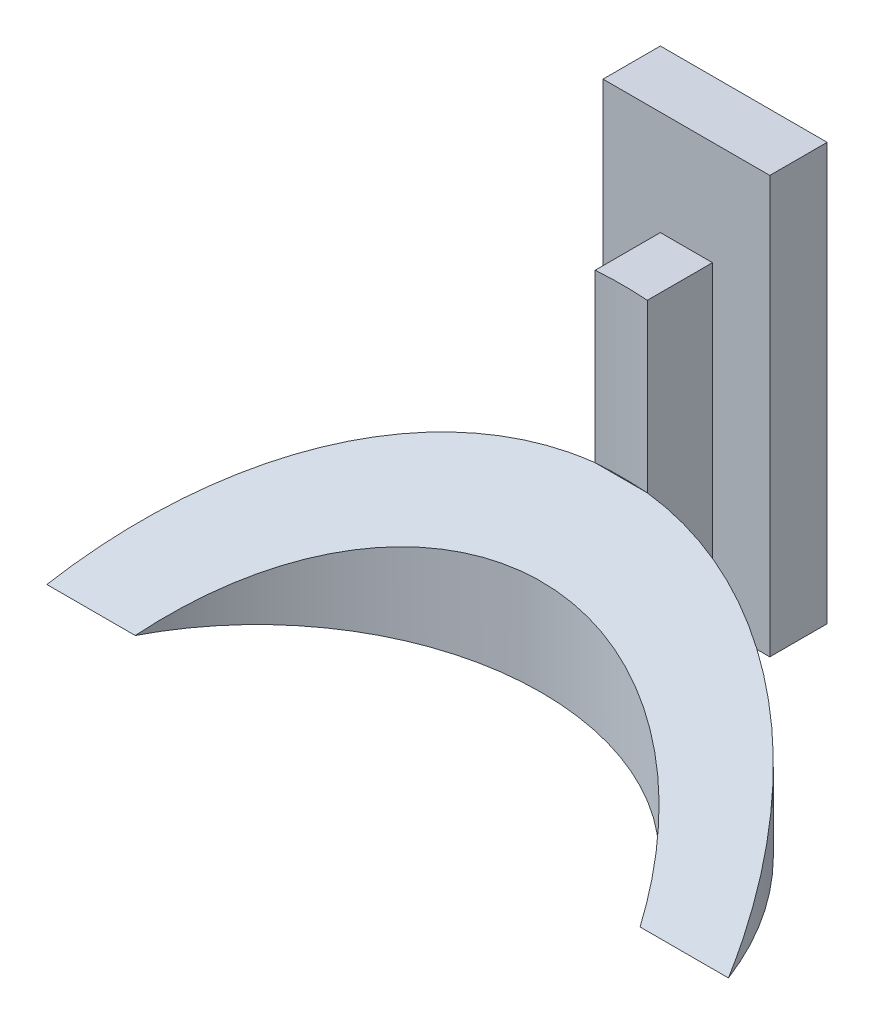
ISO-10303-21;
HEADER;
FILE_DESCRIPTION(('STEP AP214'),'2;1');
FILE_NAME('part.step','',(''),(''),'','','');
FILE_SCHEMA(('AUTOMOTIVE_DESIGN { 1 0 10303 214 1 1 1 1 }'));
ENDSEC;
DATA;
#1=APPLICATION_CONTEXT('core data for automotive mechanical design processes');
#2=APPLICATION_PROTOCOL_DEFINITION('international standard','automotive_design',2000,#1);
#3=PRODUCT_CONTEXT('',#1,'mechanical');
#4=PRODUCT('Part','Part','',(#3));
#5=PRODUCT_RELATED_PRODUCT_CATEGORY('part','',(#4));
#6=PRODUCT_DEFINITION_FORMATION('','',#4);
#7=PRODUCT_DEFINITION_CONTEXT('part definition',#1,'design');
#8=PRODUCT_DEFINITION('design','',#6,#7);
#9=PRODUCT_DEFINITION_SHAPE('','',#8);
#10=(LENGTH_UNIT() NAMED_UNIT(*) SI_UNIT(.MILLI.,.METRE.));
#11=(NAMED_UNIT(*) PLANE_ANGLE_UNIT() SI_UNIT($,.RADIAN.));
#12=(NAMED_UNIT(*) SI_UNIT($,.STERADIAN.) SOLID_ANGLE_UNIT());
#13=UNCERTAINTY_MEASURE_WITH_UNIT(LENGTH_MEASURE(1.E-05),#10,'distance_accuracy_value','');
#14=(GEOMETRIC_REPRESENTATION_CONTEXT(3) GLOBAL_UNCERTAINTY_ASSIGNED_CONTEXT((#13)) GLOBAL_UNIT_ASSIGNED_CONTEXT((#10,
#11,#12)) REPRESENTATION_CONTEXT('',''));
#15=CARTESIAN_POINT('',(0.,0.,0.));
#16=DIRECTION('',(0.,0.,1.));
#17=DIRECTION('',(1.,0.,0.));
#18=AXIS2_PLACEMENT_3D('',#15,#16,#17);
#19=CARTESIAN_POINT('',(-8.,30.,0.));
#20=DIRECTION('',(-1.,0.,0.));
#21=DIRECTION('',(0.,0.,1.));
#22=AXIS2_PLACEMENT_3D('',#19,#20,#21);
#23=PLANE('',#22);
#24=DIRECTION('',(0.,0.,-1.));
#25=VECTOR('',#24,1.);
#26=CARTESIAN_POINT('',(-8.,0.,0.));
#27=LINE('',#26,#25);
#28=CARTESIAN_POINT('',(-8.,0.,3.));
#29=VERTEX_POINT('',#28);
#30=CARTESIAN_POINT('',(-8.,0.,-2.5));
#31=VERTEX_POINT('',#30);
#32=EDGE_CURVE('E82',#29,#31,#27,.T.);
#33=ORIENTED_EDGE('',*,*,#32,.F.);
#34=DIRECTION('',(0.,1.,0.));
#35=VECTOR('',#34,1.);
#36=CARTESIAN_POINT('',(-8.,-16.0078105935821,3.));
#37=LINE('',#36,#35);
#38=CARTESIAN_POINT('',(-8.,40.,3.));
#39=VERTEX_POINT('',#38);
#40=EDGE_CURVE('E237',#29,#39,#37,.T.);
#41=ORIENTED_EDGE('',*,*,#40,.T.);
#42=DIRECTION('',(0.,0.,1.));
#43=VECTOR('',#42,1.);
#44=CARTESIAN_POINT('',(-8.,40.,0.));
#45=LINE('',#44,#43);
#46=CARTESIAN_POINT('',(-8.,40.,-2.5));
#47=VERTEX_POINT('',#46);
#48=EDGE_CURVE('E86',#47,#39,#45,.T.);
#49=ORIENTED_EDGE('',*,*,#48,.F.);
#50=DIRECTION('',(0.,-1.,0.));
#51=VECTOR('',#50,1.);
#52=CARTESIAN_POINT('',(-8.,30.,-2.5));
#53=LINE('',#52,#51);
#54=EDGE_CURVE('E77',#47,#31,#53,.T.);
#55=ORIENTED_EDGE('',*,*,#54,.T.);
#56=EDGE_LOOP('',(#33,#41,#49,#55));
#57=FACE_BOUND('',#56,.T.);
#58=ADVANCED_FACE('F39',(#57),#23,.T.);
#59=CARTESIAN_POINT('',(-2.5,30.,0.));
#60=DIRECTION('',(1.,0.,0.));
#61=DIRECTION('',(0.,0.,-1.));
#62=AXIS2_PLACEMENT_3D('',#59,#60,#61);
#63=PLANE('',#62);
#64=DIRECTION('',(0.,0.,1.));
#65=VECTOR('',#64,1.);
#66=CARTESIAN_POINT('',(-2.5,30.,0.));
#67=LINE('',#66,#65);
#68=CARTESIAN_POINT('',(-2.5,30.,3.));
#69=VERTEX_POINT('',#68);
#70=CARTESIAN_POINT('',(-2.5,30.,9.25));
#71=VERTEX_POINT('',#70);
#72=EDGE_CURVE('E97',#69,#71,#67,.T.);
#73=ORIENTED_EDGE('',*,*,#72,.F.);
#74=DIRECTION('',(0.,-1.,0.));
#75=VECTOR('',#74,1.);
#76=CARTESIAN_POINT('',(-2.5,30.,3.));
#77=LINE('',#76,#75);
#78=CARTESIAN_POINT('',(-2.5,0.,3.));
#79=VERTEX_POINT('',#78);
#80=EDGE_CURVE('E187',#69,#79,#77,.T.);
#81=ORIENTED_EDGE('',*,*,#80,.T.);
#82=DIRECTION('',(0.,0.,1.));
#83=VECTOR('',#82,1.);
#84=CARTESIAN_POINT('',(-2.5,0.,0.));
#85=LINE('',#84,#83);
#86=CARTESIAN_POINT('',(-2.5,0.,9.25));
#87=VERTEX_POINT('',#86);
#88=EDGE_CURVE('E104',#79,#87,#85,.T.);
#89=ORIENTED_EDGE('',*,*,#88,.T.);
#90=DIRECTION('',(0.,-1.,0.));
#91=VECTOR('',#90,1.);
#92=CARTESIAN_POINT('',(-2.5,14.,9.25));
#93=LINE('',#92,#91);
#94=CARTESIAN_POINT('',(-2.50000000000003,14.,9.24999999999999));
#95=VERTEX_POINT('',#94);
#96=EDGE_CURVE('E105',#95,#87,#93,.T.);
#97=ORIENTED_EDGE('',*,*,#96,.F.);
#98=DIRECTION('',(0.,-1.,0.));
#99=VECTOR('',#98,1.);
#100=CARTESIAN_POINT('',(-2.5,30.,9.25));
#101=LINE('',#100,#99);
#102=EDGE_CURVE('E47',#71,#95,#101,.T.);
#103=ORIENTED_EDGE('',*,*,#102,.F.);
#104=EDGE_LOOP('',(#73,#81,#89,#97,#103));
#105=FACE_BOUND('',#104,.T.);
#106=ADVANCED_FACE('F133',(#105),#63,.F.);
#107=CARTESIAN_POINT('',(0.,30.,44.1606001094224));
#108=DIRECTION('',(0.,-1.,0.));
#109=DIRECTION('',(0.,0.,-1.));
#110=AXIS2_PLACEMENT_3D('',#107,#108,#109);
#111=CYLINDRICAL_SURFACE('',#110,35.);
#112=CARTESIAN_POINT('',(0.,14.,44.1606001094224));
#113=DIRECTION('',(0.,1.,0.));
#114=DIRECTION('',(0.,0.,1.));
#115=AXIS2_PLACEMENT_3D('',#112,#113,#114);
#116=CIRCLE('',#115,35.);
#117=CARTESIAN_POINT('',(2.5,14.,9.24999999999999));
#118=VERTEX_POINT('',#117);
#119=EDGE_CURVE('E124',#118,#95,#116,.T.);
#120=ORIENTED_EDGE('',*,*,#119,.F.);
#121=DIRECTION('',(0.,-1.,0.));
#122=VECTOR('',#121,1.);
#123=CARTESIAN_POINT('',(2.5,30.,9.25));
#124=LINE('',#123,#122);
#125=CARTESIAN_POINT('',(2.5,30.,9.25));
#126=VERTEX_POINT('',#125);
#127=EDGE_CURVE('E55',#126,#118,#124,.T.);
#128=ORIENTED_EDGE('',*,*,#127,.F.);
#129=CARTESIAN_POINT('',(0.,30.,44.1606001094224));
#130=DIRECTION('',(0.,1.,0.));
#131=DIRECTION('',(0.,0.,1.));
#132=AXIS2_PLACEMENT_3D('',#129,#130,#131);
#133=CIRCLE('',#132,35.);
#134=EDGE_CURVE('E126',#126,#71,#133,.T.);
#135=ORIENTED_EDGE('',*,*,#134,.T.);
#136=ORIENTED_EDGE('',*,*,#102,.T.);
#137=EDGE_LOOP('',(#120,#128,#135,#136));
#138=FACE_BOUND('',#137,.T.);
#139=ADVANCED_FACE('F122',(#138),#111,.F.);
#140=CARTESIAN_POINT('',(2.5,30.,0.));
#141=DIRECTION('',(-1.,0.,0.));
#142=DIRECTION('',(0.,0.,1.));
#143=AXIS2_PLACEMENT_3D('',#140,#141,#142);
#144=PLANE('',#143);
#145=DIRECTION('',(0.,0.,-1.));
#146=VECTOR('',#145,1.);
#147=CARTESIAN_POINT('',(2.5,0.,0.));
#148=LINE('',#147,#146);
#149=CARTESIAN_POINT('',(2.5,0.,9.24999999999999));
#150=VERTEX_POINT('',#149);
#151=CARTESIAN_POINT('',(2.5,0.,3.));
#152=VERTEX_POINT('',#151);
#153=EDGE_CURVE('E107',#150,#152,#148,.T.);
#154=ORIENTED_EDGE('',*,*,#153,.T.);
#155=DIRECTION('',(0.,1.,0.));
#156=VECTOR('',#155,1.);
#157=CARTESIAN_POINT('',(2.5,30.,3.));
#158=LINE('',#157,#156);
#159=CARTESIAN_POINT('',(2.5,30.,3.));
#160=VERTEX_POINT('',#159);
#161=EDGE_CURVE('E181',#152,#160,#158,.T.);
#162=ORIENTED_EDGE('',*,*,#161,.T.);
#163=DIRECTION('',(0.,0.,-1.));
#164=VECTOR('',#163,1.);
#165=CARTESIAN_POINT('',(2.5,30.,0.));
#166=LINE('',#165,#164);
#167=EDGE_CURVE('E91',#126,#160,#166,.T.);
#168=ORIENTED_EDGE('',*,*,#167,.F.);
#169=ORIENTED_EDGE('',*,*,#127,.T.);
#170=DIRECTION('',(0.,-1.,0.));
#171=VECTOR('',#170,1.);
#172=CARTESIAN_POINT('',(2.5,14.,9.24999999999999));
#173=LINE('',#172,#171);
#174=EDGE_CURVE('E110',#150,#118,#173,.F.);
#175=ORIENTED_EDGE('',*,*,#174,.F.);
#176=EDGE_LOOP('',(#154,#162,#168,#169,#175));
#177=FACE_BOUND('',#176,.T.);
#178=ADVANCED_FACE('F178',(#177),#144,.F.);
#179=CARTESIAN_POINT('',(8.,30.,0.));
#180=DIRECTION('',(-1.,0.,0.));
#181=DIRECTION('',(0.,0.,1.));
#182=AXIS2_PLACEMENT_3D('',#179,#180,#181);
#183=PLANE('',#182);
#184=DIRECTION('',(0.,0.,-1.));
#185=VECTOR('',#184,1.);
#186=CARTESIAN_POINT('',(8.,0.,0.));
#187=LINE('',#186,#185);
#188=CARTESIAN_POINT('',(8.,0.,3.));
#189=VERTEX_POINT('',#188);
#190=CARTESIAN_POINT('',(8.,0.,-2.5));
#191=VERTEX_POINT('',#190);
#192=EDGE_CURVE('E70',#189,#191,#187,.T.);
#193=ORIENTED_EDGE('',*,*,#192,.T.);
#194=DIRECTION('',(0.,-1.,0.));
#195=VECTOR('',#194,1.);
#196=CARTESIAN_POINT('',(8.,30.,-2.5));
#197=LINE('',#196,#195);
#198=CARTESIAN_POINT('',(8.,40.,-2.5));
#199=VERTEX_POINT('',#198);
#200=EDGE_CURVE('E90',#199,#191,#197,.T.);
#201=ORIENTED_EDGE('',*,*,#200,.F.);
#202=DIRECTION('',(0.,0.,1.));
#203=VECTOR('',#202,1.);
#204=CARTESIAN_POINT('',(8.,40.,0.));
#205=LINE('',#204,#203);
#206=CARTESIAN_POINT('',(8.,40.,3.));
#207=VERTEX_POINT('',#206);
#208=EDGE_CURVE('E189',#199,#207,#205,.T.);
#209=ORIENTED_EDGE('',*,*,#208,.T.);
#210=DIRECTION('',(0.,1.,0.));
#211=VECTOR('',#210,1.);
#212=CARTESIAN_POINT('',(8.,-16.0078105935821,3.));
#213=LINE('',#212,#211);
#214=EDGE_CURVE('E238',#189,#207,#213,.T.);
#215=ORIENTED_EDGE('',*,*,#214,.F.);
#216=EDGE_LOOP('',(#193,#201,#209,#215));
#217=FACE_BOUND('',#216,.T.);
#218=ADVANCED_FACE('F244',(#217),#183,.F.);
#219=CARTESIAN_POINT('',(0.,30.,-2.5));
#220=DIRECTION('',(0.,0.,1.));
#221=DIRECTION('',(1.,0.,0.));
#222=AXIS2_PLACEMENT_3D('',#219,#220,#221);
#223=PLANE('',#222);
#224=DIRECTION('',(-1.,0.,0.));
#225=VECTOR('',#224,1.);
#226=CARTESIAN_POINT('',(0.,0.,-2.5));
#227=LINE('',#226,#225);
#228=EDGE_CURVE('E94',#191,#31,#227,.T.);
#229=ORIENTED_EDGE('',*,*,#228,.T.);
#230=ORIENTED_EDGE('',*,*,#54,.F.);
#231=DIRECTION('',(1.,0.,0.));
#232=VECTOR('',#231,1.);
#233=CARTESIAN_POINT('',(0.,40.,-2.5));
#234=LINE('',#233,#232);
#235=EDGE_CURVE('E198',#47,#199,#234,.T.);
#236=ORIENTED_EDGE('',*,*,#235,.T.);
#237=ORIENTED_EDGE('',*,*,#200,.T.);
#238=EDGE_LOOP('',(#229,#230,#236,#237));
#239=FACE_BOUND('',#238,.T.);
#240=ADVANCED_FACE('F95',(#239),#223,.F.);
#241=CARTESIAN_POINT('',(0.,30.,0.));
#242=DIRECTION('',(0.,1.,0.));
#243=DIRECTION('',(0.,0.,1.));
#244=AXIS2_PLACEMENT_3D('',#241,#242,#243);
#245=PLANE('',#244);
#246=DIRECTION('',(1.,0.,0.));
#247=VECTOR('',#246,1.);
#248=CARTESIAN_POINT('',(0.,30.,3.));
#249=LINE('',#248,#247);
#250=EDGE_CURVE('E174',#69,#160,#249,.T.);
#251=ORIENTED_EDGE('',*,*,#250,.F.);
#252=ORIENTED_EDGE('',*,*,#72,.T.);
#253=ORIENTED_EDGE('',*,*,#134,.F.);
#254=ORIENTED_EDGE('',*,*,#167,.T.);
#255=EDGE_LOOP('',(#251,#252,#253,#254));
#256=FACE_BOUND('',#255,.T.);
#257=ADVANCED_FACE('F172',(#256),#245,.T.);
#258=CARTESIAN_POINT('',(0.,0.,0.));
#259=DIRECTION('',(0.,1.,0.));
#260=DIRECTION('',(0.,0.,1.));
#261=AXIS2_PLACEMENT_3D('',#258,#259,#260);
#262=PLANE('',#261);
#263=ORIENTED_EDGE('',*,*,#88,.F.);
#264=DIRECTION('',(-1.,0.,0.));
#265=VECTOR('',#264,1.);
#266=CARTESIAN_POINT('',(8.,0.,3.));
#267=LINE('',#266,#265);
#268=EDGE_CURVE('E102',#79,#29,#267,.T.);
#269=ORIENTED_EDGE('',*,*,#268,.T.);
#270=ORIENTED_EDGE('',*,*,#32,.T.);
#271=ORIENTED_EDGE('',*,*,#228,.F.);
#272=ORIENTED_EDGE('',*,*,#192,.F.);
#273=EDGE_CURVE('E191',#189,#152,#267,.T.);
#274=ORIENTED_EDGE('',*,*,#273,.T.);
#275=ORIENTED_EDGE('',*,*,#153,.F.);
#276=CARTESIAN_POINT('',(0.,0.,44.1606001094224));
#277=DIRECTION('',(0.,1.,0.));
#278=DIRECTION('',(0.,0.,1.));
#279=AXIS2_PLACEMENT_3D('',#276,#277,#278);
#280=CIRCLE('',#279,35.);
#281=CARTESIAN_POINT('',(32.6917420765551,0.,31.6606001094224));
#282=VERTEX_POINT('',#281);
#283=EDGE_CURVE('E158',#282,#150,#280,.T.);
#284=ORIENTED_EDGE('',*,*,#283,.F.);
#285=DIRECTION('',(1.,0.,0.));
#286=VECTOR('',#285,1.);
#287=CARTESIAN_POINT('',(0.,0.,31.6606001094224));
#288=LINE('',#287,#286);
#289=CARTESIAN_POINT('',(24.2138906415305,0.,31.6606001094224));
#290=VERTEX_POINT('',#289);
#291=EDGE_CURVE('E160',#290,#282,#288,.T.);
#292=ORIENTED_EDGE('',*,*,#291,.F.);
#293=CARTESIAN_POINT('',(0.,0.,44.1606001094224));
#294=DIRECTION('',(0.,1.,0.));
#295=DIRECTION('',(0.,0.,1.));
#296=AXIS2_PLACEMENT_3D('',#293,#294,#295);
#297=CIRCLE('',#296,27.25);
#298=CARTESIAN_POINT('',(-24.2138906415305,0.,31.6606001094224));
#299=VERTEX_POINT('',#298);
#300=EDGE_CURVE('E148',#290,#299,#297,.T.);
#301=ORIENTED_EDGE('',*,*,#300,.T.);
#302=CARTESIAN_POINT('',(-32.691742076555,0.,31.6606001094224));
#303=VERTEX_POINT('',#302);
#304=EDGE_CURVE('E155',#303,#299,#288,.T.);
#305=ORIENTED_EDGE('',*,*,#304,.F.);
#306=EDGE_CURVE('E142',#87,#303,#280,.T.);
#307=ORIENTED_EDGE('',*,*,#306,.F.);
#308=EDGE_LOOP('',(#263,#269,#270,#271,#272,#274,#275,#284,#292,#301,#305,#307));
#309=FACE_BOUND('',#308,.T.);
#310=ADVANCED_FACE('F100',(#309),#262,.F.);
#311=CARTESIAN_POINT('',(0.,14.,44.1606001094224));
#312=DIRECTION('',(0.,-1.,0.));
#313=DIRECTION('',(0.,0.,-1.));
#314=AXIS2_PLACEMENT_3D('',#311,#312,#313);
#315=CYLINDRICAL_SURFACE('',#314,35.);
#316=ORIENTED_EDGE('',*,*,#306,.T.);
#317=CARTESIAN_POINT('',(0.,-7.80880472390486,44.1606001094224));
#318=DIRECTION('',(0.,-0.84811096813557,-0.529818634749805));
#319=DIRECTION('',(0.,-0.529818634749805,0.84811096813557));
#320=AXIS2_PLACEMENT_3D('',#317,#318,#319);
#321=ELLIPSE('',#320,41.2681846067168,35.);
#322=EDGE_CURVE('E145',#303,#95,#321,.T.);
#323=ORIENTED_EDGE('',*,*,#322,.T.);
#324=ORIENTED_EDGE('',*,*,#96,.T.);
#325=EDGE_LOOP('',(#316,#323,#324));
#326=FACE_BOUND('',#325,.T.);
#327=ADVANCED_FACE('F140',(#326),#315,.T.);
#328=ORIENTED_EDGE('',*,*,#174,.T.);
#329=CARTESIAN_POINT('',(0.,-7.80880472390486,44.1606001094224));
#330=DIRECTION('',(0.,-0.84811096813557,-0.529818634749805));
#331=DIRECTION('',(0.,-0.529818634749805,0.84811096813557));
#332=AXIS2_PLACEMENT_3D('',#329,#330,#331);
#333=ELLIPSE('',#332,41.2681846067168,35.);
#334=EDGE_CURVE('E149',#118,#282,#333,.T.);
#335=ORIENTED_EDGE('',*,*,#334,.T.);
#336=ORIENTED_EDGE('',*,*,#283,.T.);
#337=EDGE_LOOP('',(#328,#335,#336));
#338=FACE_BOUND('',#337,.T.);
#339=ADVANCED_FACE('F207',(#338),#315,.T.);
#340=CARTESIAN_POINT('',(0.,14.,44.1606001094224));
#341=DIRECTION('',(0.,-1.,0.));
#342=DIRECTION('',(0.,0.,-1.));
#343=AXIS2_PLACEMENT_3D('',#340,#341,#342);
#344=CYLINDRICAL_SURFACE('',#343,27.25);
#345=CARTESIAN_POINT('',(0.,-7.80880472390486,44.1606001094224));
#346=DIRECTION('',(0.,-0.84811096813557,-0.529818634749805));
#347=DIRECTION('',(0.,-0.529818634749805,0.84811096813557));
#348=AXIS2_PLACEMENT_3D('',#345,#346,#347);
#349=ELLIPSE('',#348,32.1302294438009,27.25);
#350=EDGE_CURVE('E200',#299,#290,#349,.T.);
#351=ORIENTED_EDGE('',*,*,#350,.F.);
#352=ORIENTED_EDGE('',*,*,#300,.F.);
#353=EDGE_LOOP('',(#351,#352));
#354=FACE_BOUND('',#353,.T.);
#355=ADVANCED_FACE('F341',(#354),#344,.F.);
#356=CARTESIAN_POINT('',(0.,14.,0.));
#357=DIRECTION('',(0.,1.,0.));
#358=DIRECTION('',(0.,0.,1.));
#359=AXIS2_PLACEMENT_3D('',#356,#357,#358);
#360=PLANE('',#359);
#361=DIRECTION('',(-1.,0.,0.));
#362=VECTOR('',#361,1.);
#363=CARTESIAN_POINT('',(0.,14.,9.25));
#364=LINE('',#363,#362);
#365=EDGE_CURVE('E11',#118,#95,#364,.T.);
#366=ORIENTED_EDGE('',*,*,#365,.F.);
#367=ORIENTED_EDGE('',*,*,#119,.T.);
#368=EDGE_LOOP('',(#366,#367));
#369=FACE_BOUND('',#368,.T.);
#370=ADVANCED_FACE('F153',(#369),#360,.T.);
#371=CARTESIAN_POINT('',(-32.691742076555,14.2265322059047,8.88737695154027));
#372=DIRECTION('',(0.,-0.84811096813557,-0.529818634749805));
#373=DIRECTION('',(0.,0.529818634749805,-0.84811096813557));
#374=AXIS2_PLACEMENT_3D('',#371,#372,#373);
#375=PLANE('',#374);
#376=ORIENTED_EDGE('',*,*,#304,.T.);
#377=ORIENTED_EDGE('',*,*,#350,.T.);
#378=ORIENTED_EDGE('',*,*,#291,.T.);
#379=ORIENTED_EDGE('',*,*,#334,.F.);
#380=ORIENTED_EDGE('',*,*,#365,.T.);
#381=ORIENTED_EDGE('',*,*,#322,.F.);
#382=EDGE_LOOP('',(#376,#377,#378,#379,#380,#381));
#383=FACE_BOUND('',#382,.T.);
#384=ADVANCED_FACE('F307',(#383),#375,.F.);
#385=CARTESIAN_POINT('',(0.,40.,0.));
#386=DIRECTION('',(0.,1.,0.));
#387=DIRECTION('',(0.,0.,1.));
#388=AXIS2_PLACEMENT_3D('',#385,#386,#387);
#389=PLANE('',#388);
#390=ORIENTED_EDGE('',*,*,#208,.F.);
#391=ORIENTED_EDGE('',*,*,#235,.F.);
#392=ORIENTED_EDGE('',*,*,#48,.T.);
#393=DIRECTION('',(1.,0.,0.));
#394=VECTOR('',#393,1.);
#395=CARTESIAN_POINT('',(8.,40.,3.));
#396=LINE('',#395,#394);
#397=EDGE_CURVE('E236',#39,#207,#396,.T.);
#398=ORIENTED_EDGE('',*,*,#397,.T.);
#399=EDGE_LOOP('',(#390,#391,#392,#398));
#400=FACE_BOUND('',#399,.T.);
#401=ADVANCED_FACE('F234',(#400),#389,.T.);
#402=CARTESIAN_POINT('',(8.,-16.0078105935821,3.));
#403=DIRECTION('',(0.,0.,1.));
#404=DIRECTION('',(1.,0.,0.));
#405=AXIS2_PLACEMENT_3D('',#402,#403,#404);
#406=PLANE('',#405);
#407=ORIENTED_EDGE('',*,*,#80,.F.);
#408=ORIENTED_EDGE('',*,*,#250,.T.);
#409=ORIENTED_EDGE('',*,*,#161,.F.);
#410=ORIENTED_EDGE('',*,*,#273,.F.);
#411=ORIENTED_EDGE('',*,*,#214,.T.);
#412=ORIENTED_EDGE('',*,*,#397,.F.);
#413=ORIENTED_EDGE('',*,*,#40,.F.);
#414=ORIENTED_EDGE('',*,*,#268,.F.);
#415=EDGE_LOOP('',(#407,#408,#409,#410,#411,#412,#413,#414));
#416=FACE_BOUND('',#415,.T.);
#417=ADVANCED_FACE('F241',(#416),#406,.T.);
#418=CLOSED_SHELL('',(#58,#106,#139,#178,#218,#240,#257,#310,#327,#339,#355,#370,#384,#401,#417));
#419=MANIFOLD_SOLID_BREP('B2',#418);
#420=ADVANCED_BREP_SHAPE_REPRESENTATION('',(#18,#419),#14);
#421=SHAPE_DEFINITION_REPRESENTATION(#9,#420);
ENDSEC;
END-ISO-10303-21;
